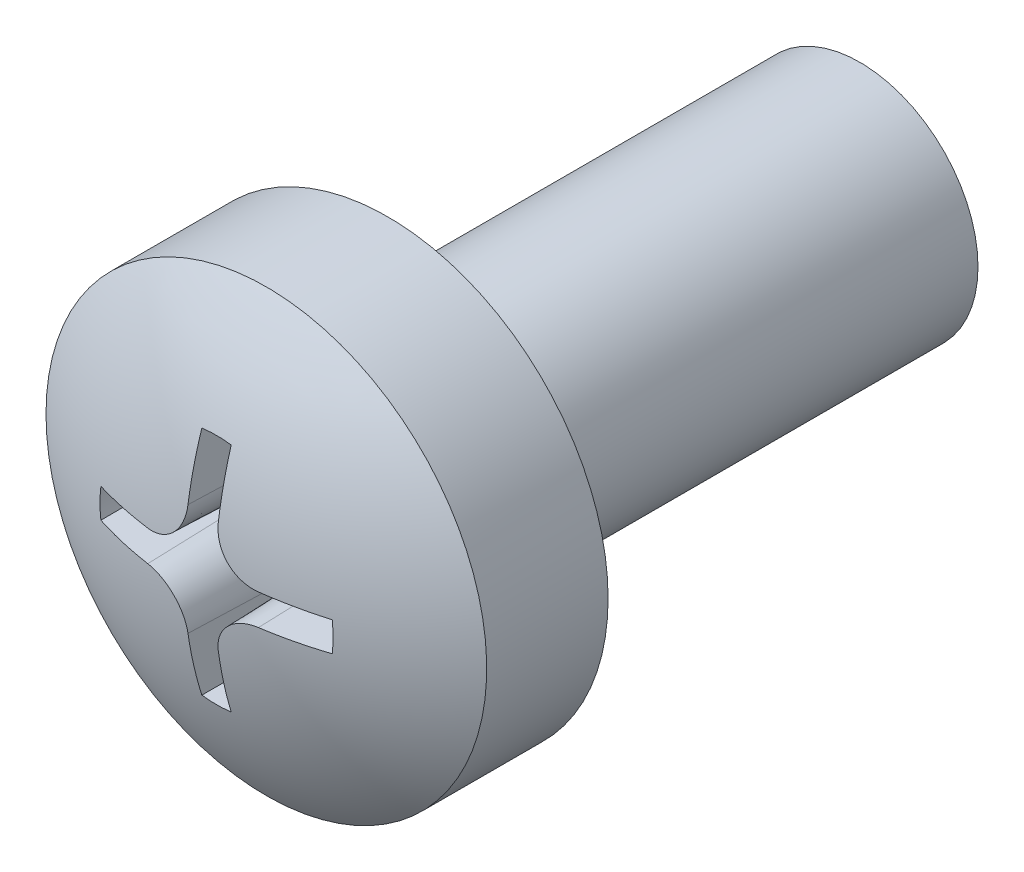
ISO-10303-21;
HEADER;
FILE_DESCRIPTION(('STEP AP214'),'2;1');
FILE_NAME('part.step','',(''),(''),'','','');
FILE_SCHEMA(('AUTOMOTIVE_DESIGN { 1 0 10303 214 1 1 1 1 }'));
ENDSEC;
DATA;
#1=APPLICATION_CONTEXT('core data for automotive mechanical design processes');
#2=APPLICATION_PROTOCOL_DEFINITION('international standard','automotive_design',2000,#1);
#3=PRODUCT_CONTEXT('',#1,'mechanical');
#4=PRODUCT('Part','Part','',(#3));
#5=PRODUCT_RELATED_PRODUCT_CATEGORY('part','',(#4));
#6=PRODUCT_DEFINITION_FORMATION('','',#4);
#7=PRODUCT_DEFINITION_CONTEXT('part definition',#1,'design');
#8=PRODUCT_DEFINITION('design','',#6,#7);
#9=PRODUCT_DEFINITION_SHAPE('','',#8);
#10=(LENGTH_UNIT() NAMED_UNIT(*) SI_UNIT(.MILLI.,.METRE.));
#11=(NAMED_UNIT(*) PLANE_ANGLE_UNIT() SI_UNIT($,.RADIAN.));
#12=(NAMED_UNIT(*) SI_UNIT($,.STERADIAN.) SOLID_ANGLE_UNIT());
#13=UNCERTAINTY_MEASURE_WITH_UNIT(LENGTH_MEASURE(1.E-05),#10,'distance_accuracy_value','');
#14=(GEOMETRIC_REPRESENTATION_CONTEXT(3) GLOBAL_UNCERTAINTY_ASSIGNED_CONTEXT((#13)) GLOBAL_UNIT_ASSIGNED_CONTEXT((#10,
#11,#12)) REPRESENTATION_CONTEXT('',''));
#15=CARTESIAN_POINT('',(0.,0.,0.));
#16=DIRECTION('',(0.,0.,1.));
#17=DIRECTION('',(1.,0.,0.));
#18=AXIS2_PLACEMENT_3D('',#15,#16,#17);
#19=CARTESIAN_POINT('',(0.,0.,6.));
#20=DIRECTION('',(0.,0.,-1.));
#21=DIRECTION('',(-1.,0.,0.));
#22=AXIS2_PLACEMENT_3D('',#19,#20,#21);
#23=CYLINDRICAL_SURFACE('',#22,1.5);
#24=CARTESIAN_POINT('',(0.,0.,6.));
#25=DIRECTION('',(0.,0.,1.));
#26=DIRECTION('',(1.,0.,0.));
#27=AXIS2_PLACEMENT_3D('',#24,#25,#26);
#28=CIRCLE('',#27,1.5);
#29=CARTESIAN_POINT('',(1.5,0.,6.));
#30=VERTEX_POINT('',#29);
#31=EDGE_CURVE('E211',#30,#30,#28,.T.);
#32=ORIENTED_EDGE('',*,*,#31,.F.);
#33=EDGE_LOOP('',(#32));
#34=FACE_BOUND('',#33,.T.);
#35=CARTESIAN_POINT('',(0.,0.,0.));
#36=DIRECTION('',(0.,0.,1.));
#37=DIRECTION('',(1.,0.,0.));
#38=AXIS2_PLACEMENT_3D('',#35,#36,#37);
#39=CIRCLE('',#38,1.5);
#40=CARTESIAN_POINT('',(1.5,0.,0.));
#41=VERTEX_POINT('',#40);
#42=EDGE_CURVE('E210',#41,#41,#39,.T.);
#43=ORIENTED_EDGE('',*,*,#42,.T.);
#44=EDGE_LOOP('',(#43));
#45=FACE_BOUND('',#44,.T.);
#46=ADVANCED_FACE('F39',(#34,#45),#23,.T.);
#47=CARTESIAN_POINT('',(0.,0.,0.));
#48=DIRECTION('',(0.,0.,1.));
#49=DIRECTION('',(1.,0.,0.));
#50=AXIS2_PLACEMENT_3D('',#47,#48,#49);
#51=PLANE('',#50);
#52=ORIENTED_EDGE('',*,*,#42,.F.);
#53=EDGE_LOOP('',(#52));
#54=FACE_BOUND('',#53,.T.);
#55=ADVANCED_FACE('F300',(#54),#51,.F.);
#56=CARTESIAN_POINT('',(0.,0.,6.));
#57=DIRECTION('',(0.,0.,-1.));
#58=DIRECTION('',(-1.,0.,0.));
#59=AXIS2_PLACEMENT_3D('',#56,#57,#58);
#60=PLANE('',#59);
#61=CARTESIAN_POINT('',(0.,0.,6.));
#62=DIRECTION('',(0.,0.,-1.));
#63=DIRECTION('',(-1.,0.,0.));
#64=AXIS2_PLACEMENT_3D('',#61,#62,#63);
#65=CIRCLE('',#64,2.79999990016222);
#66=CARTESIAN_POINT('',(-2.79999990016222,0.,6.));
#67=VERTEX_POINT('',#66);
#68=EDGE_CURVE('E207',#67,#67,#65,.T.);
#69=ORIENTED_EDGE('',*,*,#68,.T.);
#70=EDGE_LOOP('',(#69));
#71=FACE_BOUND('',#70,.T.);
#72=ORIENTED_EDGE('',*,*,#31,.T.);
#73=EDGE_LOOP('',(#72));
#74=FACE_BOUND('',#73,.T.);
#75=ADVANCED_FACE('F305',(#71,#74),#60,.T.);
#76=CARTESIAN_POINT('',(0.,0.,-0.393620134621003));
#77=DIRECTION('',(0.,0.,-1.));
#78=DIRECTION('',(-1.,0.,0.));
#79=AXIS2_PLACEMENT_3D('',#76,#77,#78);
#80=CYLINDRICAL_SURFACE('',#79,2.79999990016222);
#81=CARTESIAN_POINT('',(0.,0.,7.54246307978926));
#82=DIRECTION('',(0.,0.,-1.));
#83=DIRECTION('',(-1.,0.,0.));
#84=AXIS2_PLACEMENT_3D('',#81,#82,#83);
#85=CIRCLE('',#84,2.79999990016222);
#86=CARTESIAN_POINT('',(-2.79999990016222,0.,7.54246307978926));
#87=VERTEX_POINT('',#86);
#88=EDGE_CURVE('E155',#87,#87,#85,.T.);
#89=ORIENTED_EDGE('',*,*,#88,.T.);
#90=EDGE_LOOP('',(#89));
#91=FACE_BOUND('',#90,.T.);
#92=ORIENTED_EDGE('',*,*,#68,.F.);
#93=EDGE_LOOP('',(#92));
#94=FACE_BOUND('',#93,.T.);
#95=ADVANCED_FACE('F312',(#91,#94),#80,.T.);
#96=CARTESIAN_POINT('',(0.,0.,3.40000011175871));
#97=DIRECTION('',(0.,0.,-1.));
#98=DIRECTION('',(1.,0.,0.));
#99=AXIS2_PLACEMENT_3D('',#96,#97,#98);
#100=SPHERICAL_SURFACE('',#99,4.99999988824129);
#101=CARTESIAN_POINT('',(0.,0.,8.17541838215017));
#102=DIRECTION('',(0.,0.,-1.));
#103=DIRECTION('',(-1.,0.,0.));
#104=AXIS2_PLACEMENT_3D('',#101,#102,#103);
#105=CIRCLE('',#104,1.4816812157899);
#106=CARTESIAN_POINT('',(0.18668120666759,1.46987392394782,8.17541838215014));
#107=VERTEX_POINT('',#106);
#108=CARTESIAN_POINT('',(-0.186681206667593,1.46987392394782,8.17541838215014));
#109=VERTEX_POINT('',#108);
#110=EDGE_CURVE('E11',#107,#109,#105,.F.);
#111=ORIENTED_EDGE('',*,*,#110,.F.);
#112=CARTESIAN_POINT('',(0.0198956640512633,0.,3.39930533986049));
#113=DIRECTION('',(0.999390827019096,0.,-0.034899496702501));
#114=DIRECTION('',(-0.034899496702501,0.,-0.999390827019096));
#115=AXIS2_PLACEMENT_3D('',#112,#113,#114);
#116=CIRCLE('',#115,4.99996025606773);
#117=CARTESIAN_POINT('',(0.192632610704328,0.708178557647151,8.34584429553512));
#118=VERTEX_POINT('',#117);
#119=EDGE_CURVE('E46',#107,#118,#116,.T.);
#120=ORIENTED_EDGE('',*,*,#119,.T.);
#121=CARTESIAN_POINT('',(0.192631650862954,0.708378557647151,8.34581569147501));
#122=CARTESIAN_POINT('',(0.192737639690806,0.679822741796073,8.34990414397343));
#123=CARTESIAN_POINT('',(0.195268867839181,0.651227392830895,8.35364633624144));
#124=CARTESIAN_POINT('',(0.205046889209158,0.594767038274589,8.36034605517117));
#125=CARTESIAN_POINT('',(0.212292618678018,0.566901869404939,8.36330375862851));
#126=CARTESIAN_POINT('',(0.231373694375068,0.51267267841366,8.36834660632538));
#127=CARTESIAN_POINT('',(0.24321326807329,0.486310064716558,8.37043094316672));
#128=CARTESIAN_POINT('',(0.271156607880554,0.435900324544808,8.37366034910124));
#129=CARTESIAN_POINT('',(0.287258672100205,0.411852279143785,8.37480579232145));
#130=CARTESIAN_POINT('',(0.323072075489885,0.367028886470806,8.37611580257173));
#131=CARTESIAN_POINT('',(0.342740648168188,0.346219679514825,8.37629128935958));
#132=CARTESIAN_POINT('',(0.385246757538768,0.30814670944778,8.37568534569509));
#133=CARTESIAN_POINT('',(0.408084792807392,0.290883505206881,8.37490376453834));
#134=CARTESIAN_POINT('',(0.456147210008961,0.260464262414973,8.37241339517053));
#135=CARTESIAN_POINT('',(0.481359759209805,0.247289131136678,8.37070902247328));
#136=CARTESIAN_POINT('',(0.533541444049374,0.225283958921734,8.36642588708089));
#137=CARTESIAN_POINT('',(0.560509920861878,0.216452298826715,8.36384745082543));
#138=CARTESIAN_POINT('',(0.606876295057338,0.205379627868596,8.35882076515575));
#139=CARTESIAN_POINT('',(0.626020977094074,0.201943221890058,8.35658129607485));
#140=CARTESIAN_POINT('',(0.664502044043211,0.197253494550335,8.3517582366185));
#141=CARTESIAN_POINT('',(0.683838077649067,0.195996727127303,8.349175196413));
#142=CARTESIAN_POINT('',(0.703167546290468,0.195835015722444,8.34643346629546));
#143=B_SPLINE_CURVE_WITH_KNOTS('',3,(#121,#122,#123,#124,#125,#126,#127,#128,#129,#130,#131,
#132,#133,#134,#135,#136,#137,#138,#139,#140,#141,#142),.UNSPECIFIED.,.F.,.F.,(4,2,2,2,2,2,2,2,
2,2,4),(0.,0.0864417829586746,0.172864068455127,0.259366073122685,0.345833591994609,
0.431325646912079,0.516831165542017,0.601931114274005,0.686999315371811,0.745618262708562,
0.804144447281415),.UNSPECIFIED.);
#144=CARTESIAN_POINT('',(0.702917362553185,0.19583721033533,8.3464689381926));
#145=VERTEX_POINT('',#144);
#146=EDGE_CURVE('E282',#118,#145,#143,.T.);
#147=ORIENTED_EDGE('',*,*,#146,.T.);
#148=CARTESIAN_POINT('',(0.000105390153350939,0.0259265633149154,3.39909472873738));
#149=DIRECTION('',(0.00406243901494415,0.999382570249833,-0.034899496702501));
#150=DIRECTION('',(0.,0.0348997846864301,0.999390816962434));
#151=AXIS2_PLACEMENT_3D('',#148,#149,#150);
#152=CIRCLE('',#151,4.99993258603575);
#153=CARTESIAN_POINT('',(1.46986565043204,0.186746338396853,8.17541838215017));
#154=VERTEX_POINT('',#153);
#155=EDGE_CURVE('E280',#154,#145,#152,.F.);
#156=ORIENTED_EDGE('',*,*,#155,.F.);
#157=CARTESIAN_POINT('',(0.,0.,8.17541838215017));
#158=DIRECTION('',(0.,0.,-1.));
#159=DIRECTION('',(-1.,0.,0.));
#160=AXIS2_PLACEMENT_3D('',#157,#158,#159);
#161=CIRCLE('',#160,1.4816812157899);
#162=CARTESIAN_POINT('',(1.46986565043204,-0.186746338396852,8.17541838215014));
#163=VERTEX_POINT('',#162);
#164=EDGE_CURVE('E278',#163,#154,#161,.F.);
#165=ORIENTED_EDGE('',*,*,#164,.F.);
#166=CARTESIAN_POINT('',(0.000105390153350971,-0.0259265633149168,3.39909472873738));
#167=DIRECTION('',(0.00406243901494512,-0.999382570249833,-0.034899496702501));
#168=DIRECTION('',(0.,0.0348997846864301,-0.999390816962434));
#169=AXIS2_PLACEMENT_3D('',#166,#167,#168);
#170=CIRCLE('',#169,4.99993258603575);
#171=CARTESIAN_POINT('',(0.702917362553185,-0.195837210335331,8.3464689381926));
#172=VERTEX_POINT('',#171);
#173=EDGE_CURVE('E275',#163,#172,#170,.T.);
#174=ORIENTED_EDGE('',*,*,#173,.T.);
#175=CARTESIAN_POINT('',(0.192631650862954,-0.708378557647152,8.34581569147501));
#176=CARTESIAN_POINT('',(0.192737639690806,-0.679822741796074,8.34990414397343));
#177=CARTESIAN_POINT('',(0.195268867839181,-0.651227392830896,8.35364633624144));
#178=CARTESIAN_POINT('',(0.205046889209158,-0.59476703827459,8.36034605517117));
#179=CARTESIAN_POINT('',(0.212292618678018,-0.56690186940494,8.36330375862851));
#180=CARTESIAN_POINT('',(0.231373694375068,-0.512672678413661,8.36834660632538));
#181=CARTESIAN_POINT('',(0.24321326807329,-0.486310064716559,8.37043094316672));
#182=CARTESIAN_POINT('',(0.271156607880554,-0.435900324544809,8.37366034910124));
#183=CARTESIAN_POINT('',(0.287258672100205,-0.411852279143786,8.37480579232145));
#184=CARTESIAN_POINT('',(0.323072075489885,-0.367028886470807,8.37611580257173));
#185=CARTESIAN_POINT('',(0.342740648168188,-0.346219679514826,8.37629128935958));
#186=CARTESIAN_POINT('',(0.385246757538768,-0.30814670944778,8.37568534569509));
#187=CARTESIAN_POINT('',(0.408084792807392,-0.290883505206882,8.37490376453834));
#188=CARTESIAN_POINT('',(0.456147210008961,-0.260464262414974,8.37241339517053));
#189=CARTESIAN_POINT('',(0.481359759209805,-0.247289131136679,8.37070902247328));
#190=CARTESIAN_POINT('',(0.533541444049374,-0.225283958921735,8.36642588708089));
#191=CARTESIAN_POINT('',(0.560509920861877,-0.216452298826716,8.36384745082543));
#192=CARTESIAN_POINT('',(0.606876295057338,-0.205379627868597,8.35882076515575));
#193=CARTESIAN_POINT('',(0.626020977094074,-0.201943221890059,8.35658129607485));
#194=CARTESIAN_POINT('',(0.66450204404321,-0.197253494550336,8.3517582366185));
#195=CARTESIAN_POINT('',(0.683838077649067,-0.195996727127304,8.349175196413));
#196=CARTESIAN_POINT('',(0.703167546290467,-0.195835015722445,8.34643346629546));
#197=B_SPLINE_CURVE_WITH_KNOTS('',3,(#175,#176,#177,#178,#179,#180,#181,#182,#183,#184,#185,
#186,#187,#188,#189,#190,#191,#192,#193,#194,#195,#196),.UNSPECIFIED.,.F.,.F.,(4,2,2,2,2,2,2,2,
2,2,4),(0.,0.0864417829586746,0.172864068455127,0.259366073122685,0.345833591994609,
0.431325646912079,0.516831165542017,0.601931114274005,0.686999315371811,0.745618262708562,
0.804144447281415),.UNSPECIFIED.);
#198=CARTESIAN_POINT('',(0.192632610704328,-0.708178557647152,8.34584429553512));
#199=VERTEX_POINT('',#198);
#200=EDGE_CURVE('E269',#199,#172,#197,.T.);
#201=ORIENTED_EDGE('',*,*,#200,.F.);
#202=CARTESIAN_POINT('',(0.0198956640512633,0.,3.39930533986049));
#203=DIRECTION('',(0.999390827019096,0.,-0.034899496702501));
#204=DIRECTION('',(-0.034899496702501,0.,-0.999390827019096));
#205=AXIS2_PLACEMENT_3D('',#202,#203,#204);
#206=CIRCLE('',#205,4.99996025606773);
#207=CARTESIAN_POINT('',(0.186681206667591,-1.46987392394782,8.17541838215017));
#208=VERTEX_POINT('',#207);
#209=EDGE_CURVE('E267',#208,#199,#206,.F.);
#210=ORIENTED_EDGE('',*,*,#209,.F.);
#211=CARTESIAN_POINT('',(0.,0.,8.17541838215017));
#212=DIRECTION('',(0.,0.,-1.));
#213=DIRECTION('',(-1.,0.,0.));
#214=AXIS2_PLACEMENT_3D('',#211,#212,#213);
#215=CIRCLE('',#214,1.4816812157899);
#216=CARTESIAN_POINT('',(-0.186681206667593,-1.46987392394782,8.17541838215014));
#217=VERTEX_POINT('',#216);
#218=EDGE_CURVE('E264',#208,#217,#215,.T.);
#219=ORIENTED_EDGE('',*,*,#218,.T.);
#220=CARTESIAN_POINT('',(-0.0198956640512654,0.,3.39930533986049));
#221=DIRECTION('',(-0.999390827019096,0.,-0.034899496702501));
#222=DIRECTION('',(-0.034899496702501,0.,0.999390827019096));
#223=AXIS2_PLACEMENT_3D('',#220,#221,#222);
#224=CIRCLE('',#223,4.99996025606773);
#225=CARTESIAN_POINT('',(-0.19263261070433,-0.708178557647151,8.34584429553512));
#226=VERTEX_POINT('',#225);
#227=EDGE_CURVE('E260',#217,#226,#224,.T.);
#228=ORIENTED_EDGE('',*,*,#227,.T.);
#229=CARTESIAN_POINT('',(-0.70316754629047,-0.195835015722445,8.34643346629546));
#230=CARTESIAN_POINT('',(-0.674619447950853,-0.196052963217916,8.35048572416475));
#231=CARTESIAN_POINT('',(-0.64604143463723,-0.198695168407334,8.35418904161906));
#232=CARTESIAN_POINT('',(-0.589634494727846,-0.208689654905481,8.36080680147558));
#233=CARTESIAN_POINT('',(-0.561805393198952,-0.216040826152062,8.36372142956822));
#234=CARTESIAN_POINT('',(-0.50766612082123,-0.235323893103952,8.36867508610456));
#235=CARTESIAN_POINT('',(-0.481357369172765,-0.247259991703852,8.370713307523));
#236=CARTESIAN_POINT('',(-0.431071022991569,-0.275383990623327,8.37384890996341));
#237=CARTESIAN_POINT('',(-0.407092510169895,-0.291570206692358,8.37494666294437));
#238=CARTESIAN_POINT('',(-0.362416703115867,-0.327538701485094,8.37616180832018));
#239=CARTESIAN_POINT('',(-0.34168588735275,-0.347278991317759,8.37628996638402));
#240=CARTESIAN_POINT('',(-0.303780328011577,-0.389912448398922,8.37559036471605));
#241=CARTESIAN_POINT('',(-0.286606147147996,-0.412806113607388,8.37476245385545));
#242=CARTESIAN_POINT('',(-0.25636685808405,-0.460969475916929,8.37218162580557));
#243=CARTESIAN_POINT('',(-0.243283863198687,-0.486228184526672,8.37043282748058));
#244=CARTESIAN_POINT('',(-0.22146899790456,-0.538485231439468,8.36606389829698));
#245=CARTESIAN_POINT('',(-0.212735526227358,-0.565482925398504,8.36344408869266));
#246=CARTESIAN_POINT('',(-0.201823996880683,-0.61191361527353,8.35834781298739));
#247=CARTESIAN_POINT('',(-0.198453223120025,-0.631098599357625,8.3560784464194));
#248=CARTESIAN_POINT('',(-0.193901764340931,-0.669652448873598,8.35119687303864));
#249=CARTESIAN_POINT('',(-0.192717622166763,-0.689020975292663,8.34858521441869));
#250=CARTESIAN_POINT('',(-0.192631650862956,-0.708378557647151,8.34581569147501));
#251=B_SPLINE_CURVE_WITH_KNOTS('',3,(#229,#230,#231,#232,#233,#234,#235,#236,#237,#238,#239,
#240,#241,#242,#243,#244,#245,#246,#247,#248,#249,#250),.UNSPECIFIED.,.F.,.F.,(4,2,2,2,2,2,2,2,
2,2,4),(0.,0.0864053436114193,0.172790326060609,0.259254685287909,0.34568483171133,
0.431153892876567,0.51663646625136,0.601739908197796,0.686811996276178,0.745524819849982,
0.804144736260156),.UNSPECIFIED.);
#252=CARTESIAN_POINT('',(-0.702917362553187,-0.195837210335331,8.3464689381926));
#253=VERTEX_POINT('',#252);
#254=EDGE_CURVE('E253',#253,#226,#251,.T.);
#255=ORIENTED_EDGE('',*,*,#254,.F.);
#256=CARTESIAN_POINT('',(-0.000105390153349066,-0.0259265633149167,3.39909472873738));
#257=DIRECTION('',(-0.0040624390149453,-0.999382570249833,-0.034899496702501));
#258=DIRECTION('',(0.,0.0348997846864301,-0.999390816962434));
#259=AXIS2_PLACEMENT_3D('',#256,#257,#258);
#260=CIRCLE('',#259,4.99993258603575);
#261=CARTESIAN_POINT('',(-1.46986565043204,-0.186746338396853,8.17541838215019));
#262=VERTEX_POINT('',#261);
#263=EDGE_CURVE('E261',#262,#253,#260,.F.);
#264=ORIENTED_EDGE('',*,*,#263,.F.);
#265=CARTESIAN_POINT('',(0.,0.,8.17541838215019));
#266=DIRECTION('',(0.,0.,-1.));
#267=DIRECTION('',(-1.,0.,0.));
#268=AXIS2_PLACEMENT_3D('',#265,#266,#267);
#269=CIRCLE('',#268,1.4816812157899);
#270=CARTESIAN_POINT('',(-1.46986565043204,0.186746338396852,8.17541838215014));
#271=VERTEX_POINT('',#270);
#272=EDGE_CURVE('E523',#262,#271,#269,.T.);
#273=ORIENTED_EDGE('',*,*,#272,.T.);
#274=CARTESIAN_POINT('',(-0.000105390153349066,0.0259265633149167,3.39909472873738));
#275=DIRECTION('',(-0.00406243901494529,0.999382570249833,-0.034899496702501));
#276=DIRECTION('',(0.,0.0348997846864301,0.999390816962434));
#277=AXIS2_PLACEMENT_3D('',#274,#275,#276);
#278=CIRCLE('',#277,4.99993258603575);
#279=CARTESIAN_POINT('',(-0.702917362553187,0.195837210335331,8.3464689381926));
#280=VERTEX_POINT('',#279);
#281=EDGE_CURVE('E226',#271,#280,#278,.T.);
#282=ORIENTED_EDGE('',*,*,#281,.T.);
#283=CARTESIAN_POINT('',(-0.192631650862955,0.708378557647151,8.34581569147501));
#284=CARTESIAN_POINT('',(-0.192737639690808,0.679822741796074,8.34990414397343));
#285=CARTESIAN_POINT('',(-0.195268867839183,0.651227392830896,8.35364633624144));
#286=CARTESIAN_POINT('',(-0.20504688920916,0.59476703827459,8.36034605517116));
#287=CARTESIAN_POINT('',(-0.21229261867802,0.566901869404939,8.36330375862851));
#288=CARTESIAN_POINT('',(-0.231373694375069,0.51267267841366,8.36834660632538));
#289=CARTESIAN_POINT('',(-0.243213268073292,0.486310064716559,8.37043094316672));
#290=CARTESIAN_POINT('',(-0.271156607880556,0.435900324544809,8.37366034910124));
#291=CARTESIAN_POINT('',(-0.287258672100207,0.411852279143786,8.37480579232145));
#292=CARTESIAN_POINT('',(-0.323072075489887,0.367028886470806,8.37611580257173));
#293=CARTESIAN_POINT('',(-0.34274064816819,0.346219679514826,8.37629128935957));
#294=CARTESIAN_POINT('',(-0.38524675753877,0.30814670944778,8.37568534569509));
#295=CARTESIAN_POINT('',(-0.408084792807394,0.290883505206882,8.37490376453834));
#296=CARTESIAN_POINT('',(-0.456147210008963,0.260464262414974,8.37241339517053));
#297=CARTESIAN_POINT('',(-0.481359759209807,0.247289131136679,8.37070902247328));
#298=CARTESIAN_POINT('',(-0.533541444049376,0.225283958921735,8.36642588708089));
#299=CARTESIAN_POINT('',(-0.560509920861879,0.216452298826716,8.36384745082543));
#300=CARTESIAN_POINT('',(-0.60687629505734,0.205379627868597,8.35882076515575));
#301=CARTESIAN_POINT('',(-0.626020977094076,0.201943221890059,8.35658129607485));
#302=CARTESIAN_POINT('',(-0.664502044043212,0.197253494550336,8.3517582366185));
#303=CARTESIAN_POINT('',(-0.683838077649068,0.195996727127304,8.349175196413));
#304=CARTESIAN_POINT('',(-0.703167546290469,0.195835015722445,8.34643346629546));
#305=B_SPLINE_CURVE_WITH_KNOTS('',3,(#283,#284,#285,#286,#287,#288,#289,#290,#291,#292,#293,
#294,#295,#296,#297,#298,#299,#300,#301,#302,#303,#304),.UNSPECIFIED.,.F.,.F.,(4,2,2,2,2,2,2,2,
2,2,4),(0.,0.0864417829586747,0.172864068455127,0.259366073122684,0.345833591994609,
0.431325646912079,0.516831165542016,0.601931114274005,0.686999315371811,0.745618262708562,
0.804144447281415),.UNSPECIFIED.);
#306=CARTESIAN_POINT('',(-0.19263261070433,0.708178557647151,8.34584429553512));
#307=VERTEX_POINT('',#306);
#308=EDGE_CURVE('E218',#307,#280,#305,.T.);
#309=ORIENTED_EDGE('',*,*,#308,.F.);
#310=CARTESIAN_POINT('',(-0.0198956640512643,0.,3.39930533986049));
#311=DIRECTION('',(-0.999390827019096,0.,-0.034899496702501));
#312=DIRECTION('',(-0.034899496702501,0.,0.999390827019096));
#313=AXIS2_PLACEMENT_3D('',#310,#311,#312);
#314=CIRCLE('',#313,4.99996025606773);
#315=EDGE_CURVE('E214',#109,#307,#314,.F.);
#316=ORIENTED_EDGE('',*,*,#315,.F.);
#317=EDGE_LOOP('',(#111,#120,#147,#156,#165,#174,#201,#210,#219,#228,#255,#264,#273,#282,#309,#316));
#318=FACE_BOUND('',#317,.T.);
#319=ORIENTED_EDGE('',*,*,#88,.F.);
#320=EDGE_LOOP('',(#319));
#321=FACE_BOUND('',#320,.T.);
#322=ADVANCED_FACE('F228',(#318,#321),#100,.T.);
#323=CARTESIAN_POINT('',(0.,0.,8.7000001));
#324=DIRECTION('',(0.,0.,1.));
#325=DIRECTION('',(1.,0.,0.));
#326=AXIS2_PLACEMENT_3D('',#323,#324,#325);
#327=CONICAL_SURFACE('',#326,1.50000001303852,0.0349065850398867);
#328=ORIENTED_EDGE('',*,*,#110,.T.);
#329=CARTESIAN_POINT('',(-0.142142619910814,1.43009594495933,6.90000013091991));
#330=CARTESIAN_POINT('',(-0.152618658076336,1.43957885994155,7.19999461322929));
#331=CARTESIAN_POINT('',(-0.163094792502732,1.4489727928664,7.49999185208944));
#332=CARTESIAN_POINT('',(-0.184047253837866,1.46758269456637,8.09999184178282));
#333=CARTESIAN_POINT('',(-0.194523580746602,1.47679866334215,8.39999459261603));
#334=CARTESIAN_POINT('',(-0.205000003916213,1.48592565006124,8.7000001));
#335=B_SPLINE_CURVE_WITH_KNOTS('',3,(#329,#330,#331,#332,#333,#334),.UNSPECIFIED.,.F.,.F.,(4,2,
4),(0.,0.900981158642231,1.80196231389533),.UNSPECIFIED.);
#336=CARTESIAN_POINT('',(-0.142142619910814,1.43009594495933,6.90000013091991));
#337=VERTEX_POINT('',#336);
#338=EDGE_CURVE('E53',#337,#109,#335,.T.);
#339=ORIENTED_EDGE('',*,*,#338,.F.);
#340=CARTESIAN_POINT('',(0.,0.,6.90000013091991));
#341=DIRECTION('',(0.,0.,1.));
#342=DIRECTION('',(1.,0.,0.));
#343=AXIS2_PLACEMENT_3D('',#340,#341,#342);
#344=CIRCLE('',#343,1.43714262903312);
#345=CARTESIAN_POINT('',(0.142142619910811,1.43009594495933,6.90000013091991));
#346=VERTEX_POINT('',#345);
#347=EDGE_CURVE('E163',#346,#337,#344,.T.);
#348=ORIENTED_EDGE('',*,*,#347,.F.);
#349=CARTESIAN_POINT('',(0.142142619910811,1.43009594495933,6.90000013091991));
#350=CARTESIAN_POINT('',(0.152618658076333,1.43957885994155,7.19999461322929));
#351=CARTESIAN_POINT('',(0.16309479250273,1.4489727928664,7.49999185208944));
#352=CARTESIAN_POINT('',(0.184047253837863,1.46758269456637,8.09999184178282));
#353=CARTESIAN_POINT('',(0.1945235807466,1.47679866334215,8.39999459261603));
#354=CARTESIAN_POINT('',(0.205000003916211,1.48592565006124,8.7000001));
#355=B_SPLINE_CURVE_WITH_KNOTS('',3,(#349,#350,#351,#352,#353,#354),.UNSPECIFIED.,.F.,.F.,(4,2,
4),(0.,0.900981158642231,1.80196231389533),.UNSPECIFIED.);
#356=EDGE_CURVE('E147',#346,#107,#355,.T.);
#357=ORIENTED_EDGE('',*,*,#356,.T.);
#358=EDGE_LOOP('',(#328,#339,#348,#357));
#359=FACE_BOUND('',#358,.T.);
#360=ADVANCED_FACE('F167',(#359),#327,.F.);
#361=CARTESIAN_POINT('',(0.205000003916211,1.48592565006124,8.7000001));
#362=DIRECTION('',(0.999390827019096,0.,-0.034899496702501));
#363=DIRECTION('',(-0.034899496702501,0.,-0.999390827019096));
#364=AXIS2_PLACEMENT_3D('',#361,#362,#363);
#365=PLANE('',#364);
#366=ORIENTED_EDGE('',*,*,#356,.F.);
#367=DIRECTION('',(0.,1.,0.));
#368=VECTOR('',#367,1.);
#369=CARTESIAN_POINT('',(0.142142619910812,0.,6.90000013091991));
#370=LINE('',#369,#368);
#371=CARTESIAN_POINT('',(0.142142619910811,0.708178557647151,6.90000013091991));
#372=VERTEX_POINT('',#371);
#373=EDGE_CURVE('E150',#346,#372,#370,.F.);
#374=ORIENTED_EDGE('',*,*,#373,.T.);
#375=DIRECTION('',(0.034899496702501,0.,0.999390827019096));
#376=VECTOR('',#375,1.);
#377=CARTESIAN_POINT('',(0.20500000391621,0.708178557647151,8.7000001));
#378=LINE('',#377,#376);
#379=EDGE_CURVE('E156',#372,#118,#378,.T.);
#380=ORIENTED_EDGE('',*,*,#379,.T.);
#381=ORIENTED_EDGE('',*,*,#119,.F.);
#382=EDGE_LOOP('',(#366,#374,#380,#381));
#383=FACE_BOUND('',#382,.T.);
#384=ADVANCED_FACE('F149',(#383),#365,.F.);
#385=CARTESIAN_POINT('',(0.705000003916211,0.708178557647151,8.7000001));
#386=DIRECTION('',(0.,0.,-1.));
#387=DIRECTION('',(1.,0.,0.));
#388=AXIS2_PLACEMENT_3D('',#385,#386,#387);
#389=CONICAL_SURFACE('',#388,0.5,0.0349065850398867);
#390=ORIENTED_EDGE('',*,*,#379,.F.);
#391=CARTESIAN_POINT('',(0.705000003916211,0.708178557647151,6.90000013091991));
#392=DIRECTION('',(0.,0.,1.));
#393=DIRECTION('',(1.,0.,0.));
#394=AXIS2_PLACEMENT_3D('',#391,#392,#393);
#395=CIRCLE('',#394,0.562857384005399);
#396=CARTESIAN_POINT('',(0.702712036351556,0.145325823858085,6.90000013091991));
#397=VERTEX_POINT('',#396);
#398=EDGE_CURVE('E165',#372,#397,#395,.T.);
#399=ORIENTED_EDGE('',*,*,#398,.T.);
#400=DIRECTION('',(0.000141863496415148,0.0348992083697649,0.999390827019096));
#401=VECTOR('',#400,1.);
#402=CARTESIAN_POINT('',(0.702967546290468,0.208182688548215,8.7000001));
#403=LINE('',#402,#401);
#404=EDGE_CURVE('E425',#397,#145,#403,.T.);
#405=ORIENTED_EDGE('',*,*,#404,.T.);
#406=ORIENTED_EDGE('',*,*,#146,.F.);
#407=EDGE_LOOP('',(#390,#399,#405,#406));
#408=FACE_BOUND('',#407,.T.);
#409=ADVANCED_FACE('F288',(#408),#389,.T.);
#410=CARTESIAN_POINT('',(1.48592565006123,0.205000003916213,8.7000001));
#411=DIRECTION('',(0.00406243901494415,0.999382570249833,-0.034899496702501));
#412=DIRECTION('',(0.,0.0348997846864301,0.999390816962434));
#413=AXIS2_PLACEMENT_3D('',#410,#411,#412);
#414=PLANE('',#413);
#415=ORIENTED_EDGE('',*,*,#155,.T.);
#416=ORIENTED_EDGE('',*,*,#404,.F.);
#417=DIRECTION('',(-0.99999173819787,0.00406491525148502,0.));
#418=VECTOR('',#417,1.);
#419=CARTESIAN_POINT('',(0.000602343564913371,0.148179863836023,6.90000013091991));
#420=LINE('',#419,#418);
#421=CARTESIAN_POINT('',(1.43007341244828,0.142369137079488,6.90000013091991));
#422=VERTEX_POINT('',#421);
#423=EDGE_CURVE('E176',#422,#397,#420,.T.);
#424=ORIENTED_EDGE('',*,*,#423,.F.);
#425=CARTESIAN_POINT('',(1.43007341244828,0.142369137079488,6.90000013091991));
#426=CARTESIAN_POINT('',(1.43955869120937,0.152806706922151,7.19999467904414));
#427=CARTESIAN_POINT('',(1.44895568373278,0.163244730756208,7.49999195080733));
#428=CARTESIAN_POINT('',(1.46757309626977,0.184121686368453,8.09999194050071));
#429=CARTESIAN_POINT('',(1.47679351628402,0.194560618146638,8.39999465843089));
#430=CARTESIAN_POINT('',(1.48592565006123,0.205000003916213,8.7000001));
#431=B_SPLINE_CURVE_WITH_KNOTS('',3,(#425,#426,#427,#428,#429,#430),.UNSPECIFIED.,.F.,.F.,(4,2,
4),(0.,0.900977563471274,1.80195512360615),.UNSPECIFIED.);
#432=EDGE_CURVE('E419',#422,#154,#431,.T.);
#433=ORIENTED_EDGE('',*,*,#432,.T.);
#434=EDGE_LOOP('',(#415,#416,#424,#433));
#435=FACE_BOUND('',#434,.T.);
#436=ADVANCED_FACE('F240',(#435),#414,.F.);
#437=CARTESIAN_POINT('',(0.,0.,8.7000001));
#438=DIRECTION('',(0.,0.,1.));
#439=DIRECTION('',(1.,0.,0.));
#440=AXIS2_PLACEMENT_3D('',#437,#438,#439);
#441=CONICAL_SURFACE('',#440,1.50000001303852,0.0349065850398867);
#442=ORIENTED_EDGE('',*,*,#164,.T.);
#443=ORIENTED_EDGE('',*,*,#432,.F.);
#444=CARTESIAN_POINT('',(0.,0.,6.90000013091991));
#445=DIRECTION('',(0.,0.,1.));
#446=DIRECTION('',(1.,0.,0.));
#447=AXIS2_PLACEMENT_3D('',#444,#445,#446);
#448=CIRCLE('',#447,1.43714262903312);
#449=CARTESIAN_POINT('',(1.43007341244828,-0.142369137079488,6.90000013091991));
#450=VERTEX_POINT('',#449);
#451=EDGE_CURVE('E178',#450,#422,#448,.T.);
#452=ORIENTED_EDGE('',*,*,#451,.F.);
#453=CARTESIAN_POINT('',(1.43007341244828,-0.142369137079488,6.90000013091991));
#454=CARTESIAN_POINT('',(1.43955869120937,-0.152806706922151,7.19999467904414));
#455=CARTESIAN_POINT('',(1.44895568373278,-0.163244730756208,7.49999195080733));
#456=CARTESIAN_POINT('',(1.46757309626977,-0.184121686368453,8.09999194050071));
#457=CARTESIAN_POINT('',(1.47679351628402,-0.194560618146638,8.39999465843089));
#458=CARTESIAN_POINT('',(1.48592565006123,-0.205000003916213,8.7000001));
#459=B_SPLINE_CURVE_WITH_KNOTS('',3,(#453,#454,#455,#456,#457,#458),.UNSPECIFIED.,.F.,.F.,(4,2,
4),(0.,0.900977563471274,1.80195512360615),.UNSPECIFIED.);
#460=EDGE_CURVE('E413',#450,#163,#459,.T.);
#461=ORIENTED_EDGE('',*,*,#460,.T.);
#462=EDGE_LOOP('',(#442,#443,#452,#461));
#463=FACE_BOUND('',#462,.T.);
#464=ADVANCED_FACE('F296',(#463),#441,.F.);
#465=CARTESIAN_POINT('',(1.48592565006123,-0.205000003916213,8.7000001));
#466=DIRECTION('',(0.00406243901494512,-0.999382570249833,-0.034899496702501));
#467=DIRECTION('',(0.,0.0348997846864301,-0.999390816962434));
#468=AXIS2_PLACEMENT_3D('',#465,#466,#467);
#469=PLANE('',#468);
#470=ORIENTED_EDGE('',*,*,#460,.F.);
#471=DIRECTION('',(0.99999173819787,0.00406491525148599,0.));
#472=VECTOR('',#471,1.);
#473=CARTESIAN_POINT('',(0.00060234356491352,-0.148179863836024,6.90000013091991));
#474=LINE('',#473,#472);
#475=CARTESIAN_POINT('',(0.702712036351556,-0.145325823858086,6.90000013091991));
#476=VERTEX_POINT('',#475);
#477=EDGE_CURVE('E181',#450,#476,#474,.F.);
#478=ORIENTED_EDGE('',*,*,#477,.T.);
#479=DIRECTION('',(0.000141863496415188,-0.0348992083697649,0.999390827019096));
#480=VECTOR('',#479,1.);
#481=CARTESIAN_POINT('',(0.702967546290468,-0.208182688548216,8.7000001));
#482=LINE('',#481,#480);
#483=EDGE_CURVE('E435',#476,#172,#482,.T.);
#484=ORIENTED_EDGE('',*,*,#483,.T.);
#485=ORIENTED_EDGE('',*,*,#173,.F.);
#486=EDGE_LOOP('',(#470,#478,#484,#485));
#487=FACE_BOUND('',#486,.T.);
#488=ADVANCED_FACE('F408',(#487),#469,.F.);
#489=CARTESIAN_POINT('',(0.705000003916211,-0.708178557647152,8.7000001));
#490=DIRECTION('',(0.,0.,-1.));
#491=DIRECTION('',(-1.,0.,0.));
#492=AXIS2_PLACEMENT_3D('',#489,#490,#491);
#493=CONICAL_SURFACE('',#492,0.5,0.0349065850398867);
#494=ORIENTED_EDGE('',*,*,#200,.T.);
#495=ORIENTED_EDGE('',*,*,#483,.F.);
#496=CARTESIAN_POINT('',(0.705000003916211,-0.708178557647152,6.90000013091991));
#497=DIRECTION('',(0.,0.,1.));
#498=DIRECTION('',(1.,0.,0.));
#499=AXIS2_PLACEMENT_3D('',#496,#497,#498);
#500=CIRCLE('',#499,0.562857384005399);
#501=CARTESIAN_POINT('',(0.142142619910812,-0.708178557647152,6.90000013091991));
#502=VERTEX_POINT('',#501);
#503=EDGE_CURVE('E183',#502,#476,#500,.F.);
#504=ORIENTED_EDGE('',*,*,#503,.F.);
#505=DIRECTION('',(0.034899496702501,0.,0.999390827019096));
#506=VECTOR('',#505,1.);
#507=CARTESIAN_POINT('',(0.205000003916211,-0.708178557647152,8.7000001));
#508=LINE('',#507,#506);
#509=EDGE_CURVE('E399',#502,#199,#508,.T.);
#510=ORIENTED_EDGE('',*,*,#509,.T.);
#511=EDGE_LOOP('',(#494,#495,#504,#510));
#512=FACE_BOUND('',#511,.T.);
#513=ADVANCED_FACE('F250',(#512),#493,.T.);
#514=CARTESIAN_POINT('',(0.205000003916211,-1.48592565006124,8.7000001));
#515=DIRECTION('',(0.999390827019096,0.,-0.034899496702501));
#516=DIRECTION('',(-0.034899496702501,0.,-0.999390827019096));
#517=AXIS2_PLACEMENT_3D('',#514,#515,#516);
#518=PLANE('',#517);
#519=ORIENTED_EDGE('',*,*,#209,.T.);
#520=ORIENTED_EDGE('',*,*,#509,.F.);
#521=DIRECTION('',(0.,1.,0.));
#522=VECTOR('',#521,1.);
#523=CARTESIAN_POINT('',(0.142142619910812,0.,6.90000013091991));
#524=LINE('',#523,#522);
#525=CARTESIAN_POINT('',(0.142142619910811,-1.43009594495933,6.90000013091991));
#526=VERTEX_POINT('',#525);
#527=EDGE_CURVE('E186',#526,#502,#524,.T.);
#528=ORIENTED_EDGE('',*,*,#527,.F.);
#529=CARTESIAN_POINT('',(0.142142619910811,-1.43009594495933,6.90000013091991));
#530=CARTESIAN_POINT('',(0.152618658076333,-1.43957885994155,7.19999461322929));
#531=CARTESIAN_POINT('',(0.16309479250273,-1.4489727928664,7.49999185208944));
#532=CARTESIAN_POINT('',(0.184047253837863,-1.46758269456637,8.09999184178282));
#533=CARTESIAN_POINT('',(0.1945235807466,-1.47679866334215,8.39999459261603));
#534=CARTESIAN_POINT('',(0.205000003916211,-1.48592565006124,8.7000001));
#535=B_SPLINE_CURVE_WITH_KNOTS('',3,(#529,#530,#531,#532,#533,#534),.UNSPECIFIED.,.F.,.F.,(4,2,
4),(0.,0.900981158642231,1.80196231389533),.UNSPECIFIED.);
#536=EDGE_CURVE('E391',#526,#208,#535,.T.);
#537=ORIENTED_EDGE('',*,*,#536,.T.);
#538=EDGE_LOOP('',(#519,#520,#528,#537));
#539=FACE_BOUND('',#538,.T.);
#540=ADVANCED_FACE('F401',(#539),#518,.F.);
#541=CARTESIAN_POINT('',(0.,0.,8.7000001));
#542=DIRECTION('',(0.,0.,1.));
#543=DIRECTION('',(-1.,0.,0.));
#544=AXIS2_PLACEMENT_3D('',#541,#542,#543);
#545=CONICAL_SURFACE('',#544,1.50000001303852,0.0349065850398867);
#546=ORIENTED_EDGE('',*,*,#536,.F.);
#547=CARTESIAN_POINT('',(0.,0.,6.90000013091991));
#548=DIRECTION('',(0.,0.,1.));
#549=DIRECTION('',(1.,0.,0.));
#550=AXIS2_PLACEMENT_3D('',#547,#548,#549);
#551=CIRCLE('',#550,1.43714262903312);
#552=CARTESIAN_POINT('',(-0.142142619910814,-1.43009594495933,6.90000013091991));
#553=VERTEX_POINT('',#552);
#554=EDGE_CURVE('E189',#526,#553,#551,.F.);
#555=ORIENTED_EDGE('',*,*,#554,.T.);
#556=CARTESIAN_POINT('',(-0.142142619910814,-1.43009594495933,6.90000013091991));
#557=CARTESIAN_POINT('',(-0.152618658076336,-1.43957885994155,7.19999461322929));
#558=CARTESIAN_POINT('',(-0.163094792502732,-1.4489727928664,7.49999185208944));
#559=CARTESIAN_POINT('',(-0.184047253837866,-1.46758269456637,8.09999184178282));
#560=CARTESIAN_POINT('',(-0.194523580746602,-1.47679866334215,8.39999459261603));
#561=CARTESIAN_POINT('',(-0.205000003916213,-1.48592565006124,8.7000001));
#562=B_SPLINE_CURVE_WITH_KNOTS('',3,(#556,#557,#558,#559,#560,#561),.UNSPECIFIED.,.F.,.F.,(4,2,
4),(0.,0.900981158642231,1.80196231389533),.UNSPECIFIED.);
#563=EDGE_CURVE('E383',#553,#217,#562,.T.);
#564=ORIENTED_EDGE('',*,*,#563,.T.);
#565=ORIENTED_EDGE('',*,*,#218,.F.);
#566=EDGE_LOOP('',(#546,#555,#564,#565));
#567=FACE_BOUND('',#566,.T.);
#568=ADVANCED_FACE('F378',(#567),#545,.F.);
#569=CARTESIAN_POINT('',(-0.205000003916213,-1.48592565006124,8.7000001));
#570=DIRECTION('',(-0.999390827019096,0.,-0.034899496702501));
#571=DIRECTION('',(-0.034899496702501,0.,0.999390827019096));
#572=AXIS2_PLACEMENT_3D('',#569,#570,#571);
#573=PLANE('',#572);
#574=ORIENTED_EDGE('',*,*,#563,.F.);
#575=DIRECTION('',(0.,-1.,0.));
#576=VECTOR('',#575,1.);
#577=CARTESIAN_POINT('',(-0.142142619910814,0.,6.90000013091991));
#578=LINE('',#577,#576);
#579=CARTESIAN_POINT('',(-0.142142619910814,-0.708178557647151,6.90000013091991));
#580=VERTEX_POINT('',#579);
#581=EDGE_CURVE('E191',#553,#580,#578,.F.);
#582=ORIENTED_EDGE('',*,*,#581,.T.);
#583=DIRECTION('',(-0.034899496702501,0.,0.999390827019096));
#584=VECTOR('',#583,1.);
#585=CARTESIAN_POINT('',(-0.205000003916213,-0.708178557647151,8.7000001));
#586=LINE('',#585,#584);
#587=EDGE_CURVE('E392',#580,#226,#586,.T.);
#588=ORIENTED_EDGE('',*,*,#587,.T.);
#589=ORIENTED_EDGE('',*,*,#227,.F.);
#590=EDGE_LOOP('',(#574,#582,#588,#589));
#591=FACE_BOUND('',#590,.T.);
#592=ADVANCED_FACE('F248',(#591),#573,.F.);
#593=CARTESIAN_POINT('',(-0.705000003916213,-0.708178557647151,8.7000001));
#594=DIRECTION('',(0.,0.,-1.));
#595=DIRECTION('',(-1.,0.,0.));
#596=AXIS2_PLACEMENT_3D('',#593,#594,#595);
#597=CONICAL_SURFACE('',#596,0.5,0.0349065850398867);
#598=ORIENTED_EDGE('',*,*,#254,.T.);
#599=ORIENTED_EDGE('',*,*,#587,.F.);
#600=CARTESIAN_POINT('',(-0.705000003916213,-0.708178557647151,6.90000013091991));
#601=DIRECTION('',(0.,0.,1.));
#602=DIRECTION('',(1.,0.,0.));
#603=AXIS2_PLACEMENT_3D('',#600,#601,#602);
#604=CIRCLE('',#603,0.562857384005399);
#605=CARTESIAN_POINT('',(-0.702712036351558,-0.145325823858086,6.90000013091991));
#606=VERTEX_POINT('',#605);
#607=EDGE_CURVE('E193',#606,#580,#604,.F.);
#608=ORIENTED_EDGE('',*,*,#607,.F.);
#609=DIRECTION('',(-0.000141863496415188,-0.0348992083697649,0.999390827019096));
#610=VECTOR('',#609,1.);
#611=CARTESIAN_POINT('',(-0.70296754629047,-0.208182688548216,8.7000001));
#612=LINE('',#611,#610);
#613=EDGE_CURVE('E515',#606,#253,#612,.T.);
#614=ORIENTED_EDGE('',*,*,#613,.T.);
#615=EDGE_LOOP('',(#598,#599,#608,#614));
#616=FACE_BOUND('',#615,.T.);
#617=ADVANCED_FACE('F243',(#616),#597,.T.);
#618=CARTESIAN_POINT('',(-1.48592565006124,-0.205000003916213,8.7000001));
#619=DIRECTION('',(-0.0040624390149453,-0.999382570249833,-0.034899496702501));
#620=DIRECTION('',(0.,0.0348997846864301,-0.999390816962434));
#621=AXIS2_PLACEMENT_3D('',#618,#619,#620);
#622=PLANE('',#621);
#623=ORIENTED_EDGE('',*,*,#263,.T.);
#624=ORIENTED_EDGE('',*,*,#613,.F.);
#625=DIRECTION('',(0.99999173819787,-0.00406491525148617,0.));
#626=VECTOR('',#625,1.);
#627=CARTESIAN_POINT('',(-0.000602343564913546,-0.148179863836024,6.90000013091991));
#628=LINE('',#627,#626);
#629=CARTESIAN_POINT('',(-1.43007341244828,-0.142369137079487,6.90000013091991));
#630=VERTEX_POINT('',#629);
#631=EDGE_CURVE('E196',#630,#606,#628,.T.);
#632=ORIENTED_EDGE('',*,*,#631,.F.);
#633=CARTESIAN_POINT('',(-1.43007341244828,-0.142369137079487,6.90000013091991));
#634=CARTESIAN_POINT('',(-1.43955869120937,-0.152806706922151,7.19999467904414));
#635=CARTESIAN_POINT('',(-1.44895568373278,-0.163244730756207,7.49999195080733));
#636=CARTESIAN_POINT('',(-1.46757309626978,-0.184121686368453,8.09999194050071));
#637=CARTESIAN_POINT('',(-1.47679351628402,-0.194560618146638,8.39999465843089));
#638=CARTESIAN_POINT('',(-1.48592565006124,-0.205000003916213,8.7000001));
#639=B_SPLINE_CURVE_WITH_KNOTS('',3,(#633,#634,#635,#636,#637,#638),.UNSPECIFIED.,.F.,.F.,(4,2,
4),(0.,0.900977563471274,1.80195512360615),.UNSPECIFIED.);
#640=EDGE_CURVE('E358',#630,#262,#639,.T.);
#641=ORIENTED_EDGE('',*,*,#640,.T.);
#642=EDGE_LOOP('',(#623,#624,#632,#641));
#643=FACE_BOUND('',#642,.T.);
#644=ADVANCED_FACE('F247',(#643),#622,.F.);
#645=CARTESIAN_POINT('',(0.,0.,8.7000001));
#646=DIRECTION('',(0.,0.,1.));
#647=DIRECTION('',(-1.,0.,0.));
#648=AXIS2_PLACEMENT_3D('',#645,#646,#647);
#649=CONICAL_SURFACE('',#648,1.50000001303852,0.0349065850398867);
#650=ORIENTED_EDGE('',*,*,#640,.F.);
#651=CARTESIAN_POINT('',(0.,0.,6.90000013091991));
#652=DIRECTION('',(0.,0.,1.));
#653=DIRECTION('',(1.,0.,0.));
#654=AXIS2_PLACEMENT_3D('',#651,#652,#653);
#655=CIRCLE('',#654,1.43714262903312);
#656=CARTESIAN_POINT('',(-1.43007341244828,0.142369137079487,6.90000013091991));
#657=VERTEX_POINT('',#656);
#658=EDGE_CURVE('E199',#630,#657,#655,.F.);
#659=ORIENTED_EDGE('',*,*,#658,.T.);
#660=CARTESIAN_POINT('',(-1.43007341244828,0.142369137079487,6.90000013091991));
#661=CARTESIAN_POINT('',(-1.43955869120937,0.152806706922151,7.19999467904414));
#662=CARTESIAN_POINT('',(-1.44895568373278,0.163244730756207,7.49999195080733));
#663=CARTESIAN_POINT('',(-1.46757309626978,0.184121686368453,8.09999194050071));
#664=CARTESIAN_POINT('',(-1.47679351628402,0.194560618146638,8.39999465843089));
#665=CARTESIAN_POINT('',(-1.48592565006124,0.205000003916213,8.7000001));
#666=B_SPLINE_CURVE_WITH_KNOTS('',3,(#660,#661,#662,#663,#664,#665),.UNSPECIFIED.,.F.,.F.,(4,2,
4),(0.,0.900977563471274,1.80195512360615),.UNSPECIFIED.);
#667=EDGE_CURVE('E341',#657,#271,#666,.T.);
#668=ORIENTED_EDGE('',*,*,#667,.T.);
#669=ORIENTED_EDGE('',*,*,#272,.F.);
#670=EDGE_LOOP('',(#650,#659,#668,#669));
#671=FACE_BOUND('',#670,.T.);
#672=ADVANCED_FACE('F366',(#671),#649,.F.);
#673=CARTESIAN_POINT('',(-1.48592565006124,0.205000003916213,8.7000001));
#674=DIRECTION('',(-0.00406243901494529,0.999382570249833,-0.034899496702501));
#675=DIRECTION('',(0.,0.0348997846864301,0.999390816962434));
#676=AXIS2_PLACEMENT_3D('',#673,#674,#675);
#677=PLANE('',#676);
#678=ORIENTED_EDGE('',*,*,#667,.F.);
#679=DIRECTION('',(-0.99999173819787,-0.00406491525148616,0.));
#680=VECTOR('',#679,1.);
#681=CARTESIAN_POINT('',(-0.000602343564913545,0.148179863836024,6.90000013091991));
#682=LINE('',#681,#680);
#683=CARTESIAN_POINT('',(-0.702712036351557,0.145325823858086,6.90000013091991));
#684=VERTEX_POINT('',#683);
#685=EDGE_CURVE('E201',#657,#684,#682,.F.);
#686=ORIENTED_EDGE('',*,*,#685,.T.);
#687=DIRECTION('',(-0.000141863496415188,0.0348992083697649,0.999390827019096));
#688=VECTOR('',#687,1.);
#689=CARTESIAN_POINT('',(-0.702967546290469,0.208182688548216,8.7000001));
#690=LINE('',#689,#688);
#691=EDGE_CURVE('E339',#684,#280,#690,.T.);
#692=ORIENTED_EDGE('',*,*,#691,.T.);
#693=ORIENTED_EDGE('',*,*,#281,.F.);
#694=EDGE_LOOP('',(#678,#686,#692,#693));
#695=FACE_BOUND('',#694,.T.);
#696=ADVANCED_FACE('F238',(#695),#677,.F.);
#697=CARTESIAN_POINT('',(-0.705000003916212,0.708178557647151,8.7000001));
#698=DIRECTION('',(0.,0.,-1.));
#699=DIRECTION('',(-1.,0.,0.));
#700=AXIS2_PLACEMENT_3D('',#697,#698,#699);
#701=CONICAL_SURFACE('',#700,0.5,0.0349065850398867);
#702=ORIENTED_EDGE('',*,*,#308,.T.);
#703=ORIENTED_EDGE('',*,*,#691,.F.);
#704=CARTESIAN_POINT('',(-0.705000003916212,0.708178557647151,6.90000013091991));
#705=DIRECTION('',(0.,0.,1.));
#706=DIRECTION('',(1.,0.,0.));
#707=AXIS2_PLACEMENT_3D('',#704,#705,#706);
#708=CIRCLE('',#707,0.562857384005399);
#709=CARTESIAN_POINT('',(-0.142142619910813,0.708178557647151,6.90000013091991));
#710=VERTEX_POINT('',#709);
#711=EDGE_CURVE('E170',#710,#684,#708,.F.);
#712=ORIENTED_EDGE('',*,*,#711,.F.);
#713=DIRECTION('',(-0.034899496702501,0.,0.999390827019096));
#714=VECTOR('',#713,1.);
#715=CARTESIAN_POINT('',(-0.205000003916212,0.708178557647151,8.7000001));
#716=LINE('',#715,#714);
#717=EDGE_CURVE('E335',#710,#307,#716,.T.);
#718=ORIENTED_EDGE('',*,*,#717,.T.);
#719=EDGE_LOOP('',(#702,#703,#712,#718));
#720=FACE_BOUND('',#719,.T.);
#721=ADVANCED_FACE('F232',(#720),#701,.T.);
#722=CARTESIAN_POINT('',(-0.205000003916213,1.48592565006124,8.7000001));
#723=DIRECTION('',(-0.999390827019096,0.,-0.034899496702501));
#724=DIRECTION('',(-0.034899496702501,0.,0.999390827019096));
#725=AXIS2_PLACEMENT_3D('',#722,#723,#724);
#726=PLANE('',#725);
#727=ORIENTED_EDGE('',*,*,#315,.T.);
#728=ORIENTED_EDGE('',*,*,#717,.F.);
#729=DIRECTION('',(0.,-1.,0.));
#730=VECTOR('',#729,1.);
#731=CARTESIAN_POINT('',(-0.142142619910813,0.,6.90000013091991));
#732=LINE('',#731,#730);
#733=EDGE_CURVE('E168',#337,#710,#732,.T.);
#734=ORIENTED_EDGE('',*,*,#733,.F.);
#735=ORIENTED_EDGE('',*,*,#338,.T.);
#736=EDGE_LOOP('',(#727,#728,#734,#735));
#737=FACE_BOUND('',#736,.T.);
#738=ADVANCED_FACE('F237',(#737),#726,.F.);
#739=CARTESIAN_POINT('',(0.,0.,6.90000013091991));
#740=DIRECTION('',(0.,0.,1.));
#741=DIRECTION('',(1.,0.,0.));
#742=AXIS2_PLACEMENT_3D('',#739,#740,#741);
#743=PLANE('',#742);
#744=ORIENTED_EDGE('',*,*,#347,.T.);
#745=ORIENTED_EDGE('',*,*,#733,.T.);
#746=ORIENTED_EDGE('',*,*,#711,.T.);
#747=ORIENTED_EDGE('',*,*,#685,.F.);
#748=ORIENTED_EDGE('',*,*,#658,.F.);
#749=ORIENTED_EDGE('',*,*,#631,.T.);
#750=ORIENTED_EDGE('',*,*,#607,.T.);
#751=ORIENTED_EDGE('',*,*,#581,.F.);
#752=ORIENTED_EDGE('',*,*,#554,.F.);
#753=ORIENTED_EDGE('',*,*,#527,.T.);
#754=ORIENTED_EDGE('',*,*,#503,.T.);
#755=ORIENTED_EDGE('',*,*,#477,.F.);
#756=ORIENTED_EDGE('',*,*,#451,.T.);
#757=ORIENTED_EDGE('',*,*,#423,.T.);
#758=ORIENTED_EDGE('',*,*,#398,.F.);
#759=ORIENTED_EDGE('',*,*,#373,.F.);
#760=EDGE_LOOP('',(#744,#745,#746,#747,#748,#749,#750,#751,#752,#753,#754,#755,#756,#757,#758,#759));
#761=FACE_BOUND('',#760,.T.);
#762=ADVANCED_FACE('F161',(#761),#743,.T.);
#763=CLOSED_SHELL('',(#46,#55,#75,#95,#322,#360,#384,#409,#436,#464,#488,#513,#540,#568,#592,
#617,#644,#672,#696,#721,#738,#762));
#764=MANIFOLD_SOLID_BREP('B2',#763);
#765=ADVANCED_BREP_SHAPE_REPRESENTATION('',(#18,#764),#14);
#766=SHAPE_DEFINITION_REPRESENTATION(#9,#765);
ENDSEC;
END-ISO-10303-21;
